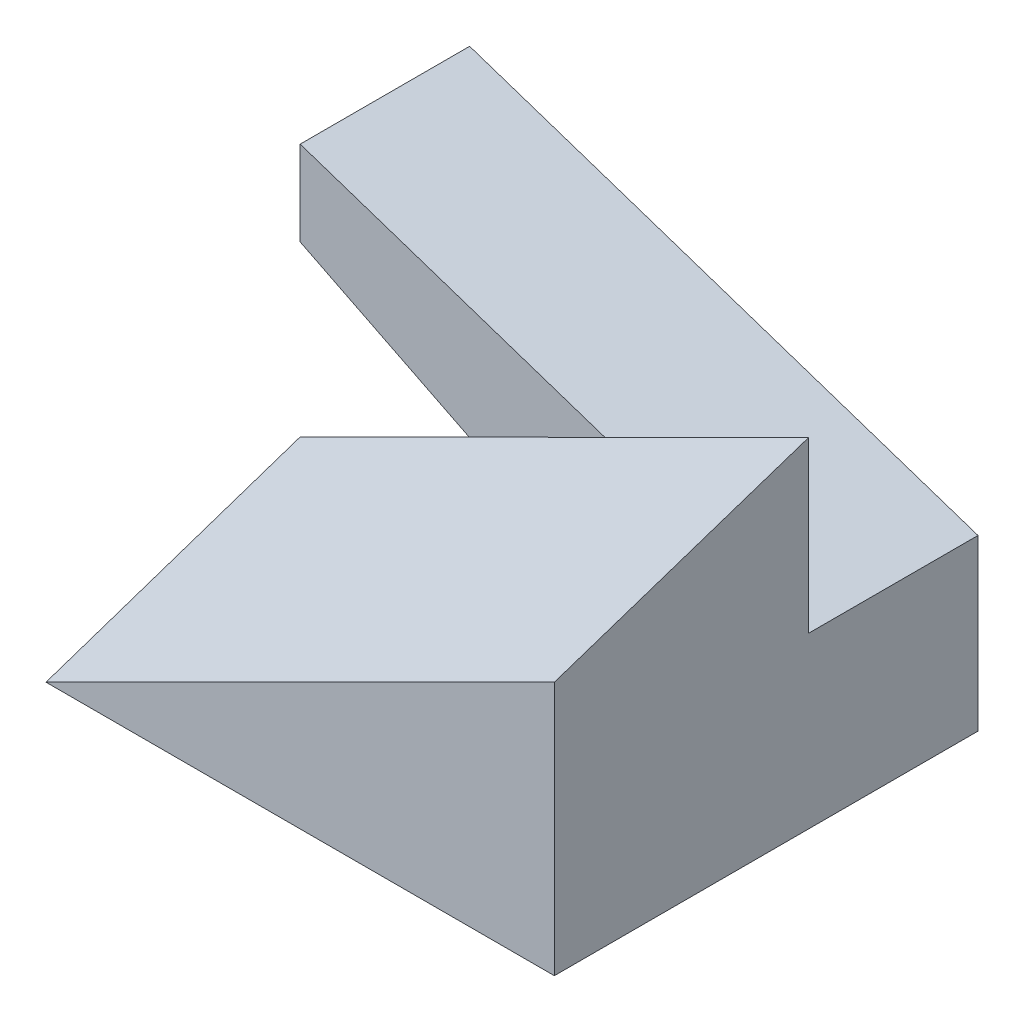
ISO-10303-21;
HEADER;
FILE_DESCRIPTION(('STEP AP214'),'2;1');
FILE_NAME('part.step','',(''),(''),'','','');
FILE_SCHEMA(('AUTOMOTIVE_DESIGN { 1 0 10303 214 1 1 1 1 }'));
ENDSEC;
DATA;
#1=APPLICATION_CONTEXT('core data for automotive mechanical design processes');
#2=APPLICATION_PROTOCOL_DEFINITION('international standard','automotive_design',2000,#1);
#3=PRODUCT_CONTEXT('',#1,'mechanical');
#4=PRODUCT('Part','Part','',(#3));
#5=PRODUCT_RELATED_PRODUCT_CATEGORY('part','',(#4));
#6=PRODUCT_DEFINITION_FORMATION('','',#4);
#7=PRODUCT_DEFINITION_CONTEXT('part definition',#1,'design');
#8=PRODUCT_DEFINITION('design','',#6,#7);
#9=PRODUCT_DEFINITION_SHAPE('','',#8);
#10=(LENGTH_UNIT() NAMED_UNIT(*) SI_UNIT(.MILLI.,.METRE.));
#11=(NAMED_UNIT(*) PLANE_ANGLE_UNIT() SI_UNIT($,.RADIAN.));
#12=(NAMED_UNIT(*) SI_UNIT($,.STERADIAN.) SOLID_ANGLE_UNIT());
#13=UNCERTAINTY_MEASURE_WITH_UNIT(LENGTH_MEASURE(1.E-05),#10,'distance_accuracy_value','');
#14=(GEOMETRIC_REPRESENTATION_CONTEXT(3) GLOBAL_UNCERTAINTY_ASSIGNED_CONTEXT((#13)) GLOBAL_UNIT_ASSIGNED_CONTEXT((#10,
#11,#12)) REPRESENTATION_CONTEXT('',''));
#15=CARTESIAN_POINT('',(0.,0.,0.));
#16=DIRECTION('',(0.,0.,1.));
#17=DIRECTION('',(1.,0.,0.));
#18=AXIS2_PLACEMENT_3D('',#15,#16,#17);
#19=CARTESIAN_POINT('',(0.,0.,10.));
#20=DIRECTION('',(1.,0.,0.));
#21=DIRECTION('',(0.,1.,0.));
#22=AXIS2_PLACEMENT_3D('',#19,#20,#21);
#23=PLANE('',#22);
#24=DIRECTION('',(0.,1.,0.));
#25=VECTOR('',#24,1.);
#26=CARTESIAN_POINT('',(0.,0.,10.));
#27=LINE('',#26,#25);
#28=CARTESIAN_POINT('',(0.,10.,10.));
#29=VERTEX_POINT('',#28);
#30=CARTESIAN_POINT('',(-9.62082689756443E-05,20.,10.0001439548259));
#31=VERTEX_POINT('',#30);
#32=EDGE_CURVE('E188',#29,#31,#27,.T.);
#33=ORIENTED_EDGE('',*,*,#32,.T.);
#34=CARTESIAN_POINT('',(8.03122140087824E-05,14.9998391758466,24.9999461922235));
#35=CARTESIAN_POINT('',(6.35012130422337E-05,15.2082061743106,24.3749574513333));
#36=CARTESIAN_POINT('',(4.86212731302606E-05,15.416569304491,23.7499674207438));
#37=CARTESIAN_POINT('',(2.23689033569722E-05,15.8332885411089,22.4999850095946));
#38=CARTESIAN_POINT('',(1.09964735376733E-05,16.0416446475464,21.8749926290348));
#39=CARTESIAN_POINT('',(-8.59548782981062E-06,16.458350546783,20.6250057555317));
#40=CARTESIAN_POINT('',(-1.6815019343616E-05,16.666700339582,20.0000112625884));
#41=CARTESIAN_POINT('',(-3.04486313341584E-05,17.0833943073055,18.7500203970858));
#42=CARTESIAN_POINT('',(-3.58627117833175E-05,17.2917384822299,18.1250240245265));
#43=CARTESIAN_POINT('',(-4.41882518469558E-05,17.7084218206219,16.8750296026702));
#44=CARTESIAN_POINT('',(-4.70997114392251E-05,17.9167609840895,16.2500315533733));
#45=CARTESIAN_POINT('',(-5.06462935525459E-05,18.3334347527002,15.0000339296414));
#46=CARTESIAN_POINT('',(-5.12814160550357E-05,18.5417693578433,14.3750343552064));
#47=CARTESIAN_POINT('',(-5.04103735177367E-05,18.9584342802512,13.1250337716458));
#48=CARTESIAN_POINT('',(-4.89042084612787E-05,19.1667645975159,12.5000327625202));
#49=CARTESIAN_POINT('',(-4.37098700090829E-05,19.5834208626023,11.2500292823616));
#50=CARTESIAN_POINT('',(-4.00216965961392E-05,19.791746810424,10.6250268113287));
#51=CARTESIAN_POINT('',(-3.52221586328211E-05,20.0000705319099,10.0000235982293));
#52=B_SPLINE_CURVE_WITH_KNOTS('',3,(#34,#35,#36,#37,#38,#39,#40,#41,#42,#43,#44,#45,#46,#47,#48,
#49,#50,#51),.UNSPECIFIED.,.F.,.F.,(4,2,2,2,2,2,2,2,4),(0.,1.97642343464449,3.95284689296459,
5.92927037283589,7.90569387213563,9.88211738897551,11.8585409219316,13.8349644702735,
15.8113880342004),.UNSPECIFIED.);
#53=CARTESIAN_POINT('',(0.,14.9998905412113,25.));
#54=VERTEX_POINT('',#53);
#55=EDGE_CURVE('E192',#31,#54,#52,.F.);
#56=ORIENTED_EDGE('',*,*,#55,.T.);
#57=DIRECTION('',(0.,1.,0.));
#58=VECTOR('',#57,1.);
#59=CARTESIAN_POINT('',(0.,0.,25.));
#60=LINE('',#59,#58);
#61=CARTESIAN_POINT('',(0.,0.,25.));
#62=VERTEX_POINT('',#61);
#63=EDGE_CURVE('E127',#62,#54,#60,.T.);
#64=ORIENTED_EDGE('',*,*,#63,.F.);
#65=DIRECTION('',(0.,0.,-1.));
#66=VECTOR('',#65,1.);
#67=CARTESIAN_POINT('',(0.,0.,25.));
#68=LINE('',#67,#66);
#69=CARTESIAN_POINT('',(0.,0.,10.));
#70=VERTEX_POINT('',#69);
#71=EDGE_CURVE('E204',#62,#70,#68,.T.);
#72=ORIENTED_EDGE('',*,*,#71,.T.);
#73=DIRECTION('',(0.,0.,-1.));
#74=VECTOR('',#73,1.);
#75=CARTESIAN_POINT('',(0.,0.,10.));
#76=LINE('',#75,#74);
#77=CARTESIAN_POINT('',(0.,0.,0.));
#78=VERTEX_POINT('',#77);
#79=EDGE_CURVE('E46',#70,#78,#76,.T.);
#80=ORIENTED_EDGE('',*,*,#79,.T.);
#81=DIRECTION('',(0.,-1.,0.));
#82=VECTOR('',#81,1.);
#83=CARTESIAN_POINT('',(0.,0.,0.));
#84=LINE('',#83,#82);
#85=CARTESIAN_POINT('',(0.,10.,0.));
#86=VERTEX_POINT('',#85);
#87=EDGE_CURVE('E98',#86,#78,#84,.T.);
#88=ORIENTED_EDGE('',*,*,#87,.F.);
#89=DIRECTION('',(0.,0.,-1.));
#90=VECTOR('',#89,1.);
#91=CARTESIAN_POINT('',(0.,10.,10.));
#92=LINE('',#91,#90);
#93=EDGE_CURVE('E83',#29,#86,#92,.T.);
#94=ORIENTED_EDGE('',*,*,#93,.F.);
#95=EDGE_LOOP('',(#33,#56,#64,#72,#80,#88,#94));
#96=FACE_BOUND('',#95,.T.);
#97=ADVANCED_FACE('F35',(#96),#23,.T.);
#98=CARTESIAN_POINT('',(-30.,0.,10.));
#99=DIRECTION('',(1.,0.,0.));
#100=DIRECTION('',(0.,0.,-1.));
#101=AXIS2_PLACEMENT_3D('',#98,#99,#100);
#102=PLANE('',#101);
#103=CARTESIAN_POINT('',(-29.9999195215301,5.03709544995943,9.99994608131372));
#104=CARTESIAN_POINT('',(-29.9999364501063,4.82724365590827,10.6249574271417));
#105=CARTESIAN_POINT('',(-29.9999514282421,4.6173879575063,11.249967462098));
#106=CARTESIAN_POINT('',(-29.999977842452,4.19766946777028,12.4999851588911));
#107=CARTESIAN_POINT('',(-29.999989278526,3.98780667643615,13.124992820728));
#108=CARTESIAN_POINT('',(-30.0000089674312,3.56807471936659,14.3750060116822));
#109=CARTESIAN_POINT('',(-30.0000172202623,3.35820555363109,15.0000115407996));
#110=CARTESIAN_POINT('',(-30.0000308923769,2.93846154801389,16.2500207006205));
#111=CARTESIAN_POINT('',(-30.0000363116605,2.72858670813213,16.8750243313241));
#112=CARTESIAN_POINT('',(-30.0000446201981,2.30883196200928,18.1250298976819));
#113=CARTESIAN_POINT('',(-30.0000475094523,2.09895205576814,18.7500318333362));
#114=CARTESIAN_POINT('',(-30.0000509831,1.67918762782197,20.0000341604611));
#115=CARTESIAN_POINT('',(-30.0000515674936,1.46930310611689,20.6250345519319));
#116=CARTESIAN_POINT('',(-30.0000505637158,1.04952971215167,21.8750338793591));
#117=CARTESIAN_POINT('',(-30.0000489755444,0.839640839891496,22.5000328153156));
#118=CARTESIAN_POINT('',(-30.000043580842,0.419858653135191,23.7500292009665));
#119=CARTESIAN_POINT('',(-30.000039774311,0.209965338639028,24.3750266506609));
#120=CARTESIAN_POINT('',(-30.0000348357029,6.97580373458341E-05,25.0000233393107));
#121=B_SPLINE_CURVE_WITH_KNOTS('',3,(#103,#104,#105,#106,#107,#108,#109,#110,#111,#112,#113,
#114,#115,#116,#117,#118,#119,#120),.UNSPECIFIED.,.F.,.F.,(4,2,2,2,2,2,2,2,4),(0.,
1.97790106511213,3.95580215410806,5.93370326484462,7.91160439518943,9.8895055432549,
11.867406707629,13.8453078876055,15.8232090834202),.UNSPECIFIED.);
#122=CARTESIAN_POINT('',(-30.0000088208538,6.45606431844688E-05,25.0000059098175));
#123=VERTEX_POINT('',#122);
#124=CARTESIAN_POINT('',(-30.,5.03714690622466,10.));
#125=VERTEX_POINT('',#124);
#126=EDGE_CURVE('E167',#123,#125,#121,.F.);
#127=ORIENTED_EDGE('',*,*,#126,.T.);
#128=DIRECTION('',(0.,-1.,0.));
#129=VECTOR('',#128,1.);
#130=CARTESIAN_POINT('',(-30.,0.,10.));
#131=LINE('',#130,#129);
#132=CARTESIAN_POINT('',(-30.,0.,10.));
#133=VERTEX_POINT('',#132);
#134=EDGE_CURVE('E196',#125,#133,#131,.T.);
#135=ORIENTED_EDGE('',*,*,#134,.T.);
#136=DIRECTION('',(0.,0.,-1.));
#137=VECTOR('',#136,1.);
#138=CARTESIAN_POINT('',(-30.,0.,25.));
#139=LINE('',#138,#137);
#140=EDGE_CURVE('E232',#123,#133,#139,.T.);
#141=ORIENTED_EDGE('',*,*,#140,.F.);
#142=EDGE_LOOP('',(#127,#135,#141));
#143=FACE_BOUND('',#142,.T.);
#144=ADVANCED_FACE('F173',(#143),#102,.F.);
#145=DIRECTION('',(0.,1.,0.));
#146=VECTOR('',#145,1.);
#147=CARTESIAN_POINT('',(-30.,5.03725660719902,10.));
#148=LINE('',#147,#146);
#149=CARTESIAN_POINT('',(-30.,15.,10.));
#150=VERTEX_POINT('',#149);
#151=CARTESIAN_POINT('',(-30.,20.,10.));
#152=VERTEX_POINT('',#151);
#153=EDGE_CURVE('E81',#150,#152,#148,.T.);
#154=ORIENTED_EDGE('',*,*,#153,.T.);
#155=DIRECTION('',(0.,0.,-1.));
#156=VECTOR('',#155,1.);
#157=CARTESIAN_POINT('',(-30.,20.,10.));
#158=LINE('',#157,#156);
#159=CARTESIAN_POINT('',(-30.,20.,0.));
#160=VERTEX_POINT('',#159);
#161=EDGE_CURVE('E73',#152,#160,#158,.T.);
#162=ORIENTED_EDGE('',*,*,#161,.T.);
#163=DIRECTION('',(0.,-1.,0.));
#164=VECTOR('',#163,1.);
#165=CARTESIAN_POINT('',(-30.,0.,0.));
#166=LINE('',#165,#164);
#167=CARTESIAN_POINT('',(-30.,15.,0.));
#168=VERTEX_POINT('',#167);
#169=EDGE_CURVE('E77',#160,#168,#166,.T.);
#170=ORIENTED_EDGE('',*,*,#169,.T.);
#171=DIRECTION('',(0.,0.,-1.));
#172=VECTOR('',#171,1.);
#173=CARTESIAN_POINT('',(-30.,15.,10.));
#174=LINE('',#173,#172);
#175=EDGE_CURVE('E84',#150,#168,#174,.T.);
#176=ORIENTED_EDGE('',*,*,#175,.F.);
#177=EDGE_LOOP('',(#154,#162,#170,#176));
#178=FACE_BOUND('',#177,.T.);
#179=ADVANCED_FACE('F75',(#178),#102,.F.);
#180=CARTESIAN_POINT('',(0.,0.,10.));
#181=DIRECTION('',(0.,0.,1.));
#182=DIRECTION('',(1.,0.,0.));
#183=AXIS2_PLACEMENT_3D('',#180,#181,#182);
#184=PLANE('',#183);
#185=CARTESIAN_POINT('',(-20.024832816438,10.0124029399315,9.99998681339724));
#186=CARTESIAN_POINT('',(-20.4404617047106,9.80509901274454,9.99998530076057));
#187=CARTESIAN_POINT('',(-20.8560907076221,9.59779531539958,9.99998386500472));
#188=CARTESIAN_POINT('',(-21.6873488731626,9.18318824054216,9.99998110050104));
#189=CARTESIAN_POINT('',(-22.1029780357917,8.97588486302971,9.99997977175323));
#190=CARTESIAN_POINT('',(-22.9342364509758,8.56127828810137,9.99997717451203));
#191=CARTESIAN_POINT('',(-23.3498657035308,8.35397509068548,9.99997590601865));
#192=CARTESIAN_POINT('',(-24.1811241772328,7.93936863297667,9.99997334799365));
#193=CARTESIAN_POINT('',(-24.5967533983798,7.73206537268375,9.99997205846203));
#194=CARTESIAN_POINT('',(-25.4280116457252,7.3174584617359,9.99996934879199));
#195=CARTESIAN_POINT('',(-25.8436406719235,7.11015481108097,9.99996792865358));
#196=CARTESIAN_POINT('',(-26.6748983149174,6.69554668996611,9.99996481408907));
#197=CARTESIAN_POINT('',(-27.090526931713,6.4882422195062,9.99996311966298));
#198=CARTESIAN_POINT('',(-27.921783493132,6.07363193259575,9.99995928047399));
#199=CARTESIAN_POINT('',(-28.3374114377553,5.86632611614523,9.9999571357111));
#200=CARTESIAN_POINT('',(-29.1686663191425,5.45171246501861,9.99995217093704));
#201=CARTESIAN_POINT('',(-29.5842932559063,5.24440463034252,9.99994935092588));
#202=CARTESIAN_POINT('',(-29.9999195215301,5.0370954501202,9.99994608083486));
#203=B_SPLINE_CURVE_WITH_KNOTS('',3,(#185,#186,#187,#188,#189,#190,#191,#192,#193,#194,#195,
#196,#197,#198,#199,#200,#201,#202),.UNSPECIFIED.,.F.,.F.,(4,2,2,2,2,2,2,2,4),(0.,
1.39337741440172,2.78675482932492,4.18013224451403,5.57350965957747,6.96688707397658,
8.36026448701699,9.75364189784338,11.1470193054391),.UNSPECIFIED.);
#204=CARTESIAN_POINT('',(-20.0248426476446,10.0124226513033,9.99999340669862));
#205=VERTEX_POINT('',#204);
#206=EDGE_CURVE('E200',#125,#205,#203,.F.);
#207=ORIENTED_EDGE('',*,*,#206,.T.);
#208=DIRECTION('',(-0.894427190999916,0.447213595499958,0.));
#209=VECTOR('',#208,1.);
#210=CARTESIAN_POINT('',(0.,0.,10.));
#211=LINE('',#210,#209);
#212=EDGE_CURVE('E93',#70,#205,#211,.T.);
#213=ORIENTED_EDGE('',*,*,#212,.F.);
#214=DIRECTION('',(1.,0.,0.));
#215=VECTOR('',#214,1.);
#216=CARTESIAN_POINT('',(0.,0.,10.));
#217=LINE('',#216,#215);
#218=EDGE_CURVE('E198',#133,#70,#217,.T.);
#219=ORIENTED_EDGE('',*,*,#218,.F.);
#220=ORIENTED_EDGE('',*,*,#134,.F.);
#221=EDGE_LOOP('',(#207,#213,#219,#220));
#222=FACE_BOUND('',#221,.T.);
#223=ADVANCED_FACE('F130',(#222),#184,.F.);
#224=CARTESIAN_POINT('',(0.,0.,25.));
#225=DIRECTION('',(0.,0.,1.));
#226=DIRECTION('',(1.,0.,0.));
#227=AXIS2_PLACEMENT_3D('',#224,#225,#226);
#228=PLANE('',#227);
#229=ORIENTED_EDGE('',*,*,#63,.T.);
#230=CARTESIAN_POINT('',(-30.0000348357029,6.97580373392273E-05,25.0000233393107));
#231=CARTESIAN_POINT('',(-28.7500483500979,0.625096806751688,25.000032390055));
#232=CARTESIAN_POINT('',(-27.5000560097484,1.25011214641075,25.0000375222373));
#233=CARTESIAN_POINT('',(-25.0000625549565,2.50012525572308,25.0000419081133));
#234=CARTESIAN_POINT('',(-23.7500614405142,3.12512302537647,25.000041161807));
#235=CARTESIAN_POINT('',(-21.2500533608829,4.37510684880745,25.0000357493416));
#236=CARTESIAN_POINT('',(-20.0000463956939,5.0000929025851,25.0000310831825));
#237=CARTESIAN_POINT('',(-17.5000302215098,6.25006051665659,25.0000202474753));
#238=CARTESIAN_POINT('',(-16.2500210125146,6.87504207695044,25.0000140779273));
#239=CARTESIAN_POINT('',(-13.7500033032552,8.12500661613528,25.0000022135007));
#240=CARTESIAN_POINT('',(-12.4999948029909,8.74998959502628,24.999996518622));
#241=CARTESIAN_POINT('',(-9.99997988636433,9.999959724923,24.9999865248092));
#242=CARTESIAN_POINT('',(-8.7499734700021,10.6249468759287,24.9999822258751));
#243=CARTESIAN_POINT('',(-6.24996194685122,11.8749237985084,24.9999745049067));
#244=CARTESIAN_POINT('',(-4.99995684006257,12.4999135700824,24.9999710828724));
#245=CARTESIAN_POINT('',(-2.49994260993918,13.7498850701496,24.9999615477884));
#246=CARTESIAN_POINT('',(-1.24993348660444,14.3748667986428,24.9999554347387));
#247=CARTESIAN_POINT('',(8.03122140060719E-05,14.9998391758466,24.9999461922235));
#248=B_SPLINE_CURVE_WITH_KNOTS('',3,(#230,#231,#232,#233,#234,#235,#236,#237,#238,#239,#240,
#241,#242,#243,#244,#245,#246,#247),.UNSPECIFIED.,.F.,.F.,(4,2,2,2,2,2,2,2,4),(0.,
4.19262748538467,8.38525494110817,12.5778823779259,16.770509807101,20.9631372377183,
25.1557646739422,29.348392111962,33.5410195369574),.UNSPECIFIED.);
#249=EDGE_CURVE('E226',#54,#123,#248,.F.);
#250=ORIENTED_EDGE('',*,*,#249,.T.);
#251=DIRECTION('',(1.,0.,0.));
#252=VECTOR('',#251,1.);
#253=CARTESIAN_POINT('',(0.,0.,25.));
#254=LINE('',#253,#252);
#255=EDGE_CURVE('E229',#123,#62,#254,.T.);
#256=ORIENTED_EDGE('',*,*,#255,.T.);
#257=EDGE_LOOP('',(#229,#250,#256));
#258=FACE_BOUND('',#257,.T.);
#259=ADVANCED_FACE('F140',(#258),#228,.T.);
#260=CARTESIAN_POINT('',(-3.52221586323467E-05,20.0000705319099,10.0000235982293));
#261=CARTESIAN_POINT('',(-0.500788223389328,19.7503290391633,10.0000271150311));
#262=CARTESIAN_POINT('',(-1.00154035798455,19.500585808735,10.0000300505982));
#263=CARTESIAN_POINT('',(-2.00304301268113,19.0010961148756,10.0000348400498));
#264=CARTESIAN_POINT('',(-2.5037935327825,18.7513496514446,10.0000366939343));
#265=CARTESIAN_POINT('',(-3.50529307907928,18.2518537330373,10.0000394008076));
#266=CARTESIAN_POINT('',(-4.00604210527468,18.002104278061,10.0000402537964));
#267=CARTESIAN_POINT('',(-5.00753883426901,17.5026027180166,10.0000410731195));
#268=CARTESIAN_POINT('',(-5.50828653706794,17.2528506129485,10.0000410394537));
#269=CARTESIAN_POINT('',(-6.50978081432943,16.7533441433284,10.0000402161553));
#270=CARTESIAN_POINT('',(-7.010527388792,16.5035897787763,10.0000394265225));
#271=CARTESIAN_POINT('',(-8.01201962347123,16.0040792189051,10.0000372347279));
#272=CARTESIAN_POINT('',(-8.51276528368788,15.7543230235859,10.0000358325659));
#273=CARTESIAN_POINT('',(-9.51425591325013,15.2548092494907,10.0000325653715));
#274=CARTESIAN_POINT('',(-10.0150008825957,15.0050516707147,10.0000307003389));
#275=CARTESIAN_POINT('',(-11.0164903503089,14.5055355700353,10.0000266547268));
#276=CARTESIAN_POINT('',(-11.5172348486765,14.255777048132,10.0000244741473));
#277=CARTESIAN_POINT('',(-12.0179792216212,14.00601827477,10.0000222094559));
#278=B_SPLINE_CURVE_WITH_KNOTS('',3,(#260,#261,#262,#263,#264,#265,#266,#267,#268,#269,#270,
#271,#272,#273,#274,#275,#276,#277),.UNSPECIFIED.,.F.,.F.,(4,2,2,2,2,2,2,2,4),(0.,
1.67872553833464,3.35745107111006,5.03617659883749,6.71490212213611,8.39362764169788,
10.0723531582557,11.7510786725539,13.429804185321),.UNSPECIFIED.);
#279=CARTESIAN_POINT('',(-12.0179626634709,14.0059850760112,10.000011104728));
#280=VERTEX_POINT('',#279);
#281=EDGE_CURVE('E11',#31,#280,#278,.T.);
#282=ORIENTED_EDGE('',*,*,#281,.F.);
#283=ORIENTED_EDGE('',*,*,#32,.F.);
#284=DIRECTION('',(0.948683298050514,-0.316227766016838,0.));
#285=VECTOR('',#284,1.);
#286=CARTESIAN_POINT('',(3.,9.,10.));
#287=LINE('',#286,#285);
#288=EDGE_CURVE('E54',#280,#29,#287,.T.);
#289=ORIENTED_EDGE('',*,*,#288,.F.);
#290=EDGE_LOOP('',(#282,#283,#289));
#291=FACE_BOUND('',#290,.T.);
#292=ADVANCED_FACE('F142',(#291),#184,.F.);
#293=CARTESIAN_POINT('',(0.,0.,10.));
#294=DIRECTION('',(-0.447213595499958,-0.894427190999916,0.));
#295=DIRECTION('',(0.894427190999916,-0.447213595499958,0.));
#296=AXIS2_PLACEMENT_3D('',#293,#294,#295);
#297=PLANE('',#296);
#298=DIRECTION('',(-0.894427190999916,0.447213595499958,0.));
#299=VECTOR('',#298,1.);
#300=CARTESIAN_POINT('',(0.,0.,0.));
#301=LINE('',#300,#299);
#302=EDGE_CURVE('E92',#78,#168,#301,.T.);
#303=ORIENTED_EDGE('',*,*,#302,.F.);
#304=ORIENTED_EDGE('',*,*,#79,.F.);
#305=ORIENTED_EDGE('',*,*,#212,.T.);
#306=DIRECTION('',(-0.894427190999916,0.447213595499958,0.));
#307=VECTOR('',#306,1.);
#308=CARTESIAN_POINT('',(0.,0.,10.));
#309=LINE('',#308,#307);
#310=EDGE_CURVE('E197',#205,#150,#309,.T.);
#311=ORIENTED_EDGE('',*,*,#310,.T.);
#312=ORIENTED_EDGE('',*,*,#175,.T.);
#313=EDGE_LOOP('',(#303,#304,#305,#311,#312));
#314=FACE_BOUND('',#313,.T.);
#315=ADVANCED_FACE('F37',(#314),#297,.T.);
#316=CARTESIAN_POINT('',(3.,9.,10.));
#317=DIRECTION('',(0.316227766016838,0.948683298050514,0.));
#318=DIRECTION('',(-0.948683298050514,0.316227766016838,0.));
#319=AXIS2_PLACEMENT_3D('',#316,#317,#318);
#320=PLANE('',#319);
#321=DIRECTION('',(0.948683298050514,-0.316227766016838,0.));
#322=VECTOR('',#321,1.);
#323=CARTESIAN_POINT('',(3.,9.,0.));
#324=LINE('',#323,#322);
#325=EDGE_CURVE('E90',#160,#86,#324,.T.);
#326=ORIENTED_EDGE('',*,*,#325,.F.);
#327=ORIENTED_EDGE('',*,*,#161,.F.);
#328=EDGE_CURVE('E107',#152,#280,#287,.T.);
#329=ORIENTED_EDGE('',*,*,#328,.T.);
#330=ORIENTED_EDGE('',*,*,#288,.T.);
#331=ORIENTED_EDGE('',*,*,#93,.T.);
#332=EDGE_LOOP('',(#326,#327,#329,#330,#331));
#333=FACE_BOUND('',#332,.T.);
#334=ADVANCED_FACE('F95',(#333),#320,.T.);
#335=CARTESIAN_POINT('',(0.,0.,0.));
#336=DIRECTION('',(0.,0.,1.));
#337=DIRECTION('',(1.,0.,0.));
#338=AXIS2_PLACEMENT_3D('',#335,#336,#337);
#339=PLANE('',#338);
#340=ORIENTED_EDGE('',*,*,#302,.T.);
#341=ORIENTED_EDGE('',*,*,#169,.F.);
#342=ORIENTED_EDGE('',*,*,#325,.T.);
#343=ORIENTED_EDGE('',*,*,#87,.T.);
#344=EDGE_LOOP('',(#340,#341,#342,#343));
#345=FACE_BOUND('',#344,.T.);
#346=ADVANCED_FACE('F88',(#345),#339,.F.);
#347=CARTESIAN_POINT('',(0.,0.,25.));
#348=DIRECTION('',(0.,1.,0.));
#349=DIRECTION('',(0.,0.,1.));
#350=AXIS2_PLACEMENT_3D('',#347,#348,#349);
#351=PLANE('',#350);
#352=ORIENTED_EDGE('',*,*,#218,.T.);
#353=ORIENTED_EDGE('',*,*,#71,.F.);
#354=ORIENTED_EDGE('',*,*,#255,.F.);
#355=ORIENTED_EDGE('',*,*,#140,.T.);
#356=EDGE_LOOP('',(#352,#353,#354,#355));
#357=FACE_BOUND('',#356,.T.);
#358=ADVANCED_FACE('F145',(#357),#351,.F.);
#359=CARTESIAN_POINT('',(-30.,5.03725660719902,10.));
#360=DIRECTION('',(0.,0.,1.));
#361=DIRECTION('',(1.,0.,0.));
#362=AXIS2_PLACEMENT_3D('',#359,#360,#361);
#363=PLANE('',#362);
#364=CARTESIAN_POINT('',(-12.0179792216212,14.00601827477,10.0000222094559));
#365=CARTESIAN_POINT('',(-12.3515980684064,13.8396175298019,10.0000206991421));
#366=CARTESIAN_POINT('',(-12.685216859495,13.6732166731674,10.0000191514765));
#367=CARTESIAN_POINT('',(-13.3524543839218,13.3404148442543,10.0000160174536));
#368=CARTESIAN_POINT('',(-13.6860731172601,13.1740138719757,10.0000144310963));
#369=CARTESIAN_POINT('',(-14.3533105799359,12.8412119194099,10.000011255702));
#370=CARTESIAN_POINT('',(-14.6869293092733,12.6748109391227,10.000009666665));
#371=CARTESIAN_POINT('',(-15.3541668098477,12.3420090624545,10.0000065166638));
#372=CARTESIAN_POINT('',(-15.6877855810846,12.1756081660736,10.0000049556996));
#373=CARTESIAN_POINT('',(-16.35502320409,11.8428065345785,10.0000018877268));
#374=CARTESIAN_POINT('',(-16.6886420558584,11.6764057994644,10.0000003807182));
#375=CARTESIAN_POINT('',(-17.3558798692458,11.3436045492141,9.99999744029996));
#376=CARTESIAN_POINT('',(-17.6894988308647,11.1772040340779,9.9999960068903));
#377=CARTESIAN_POINT('',(-18.3567368839829,10.8444032638952,9.99999322709012));
#378=CARTESIAN_POINT('',(-18.6903559754822,10.6780030088486,9.99999188069959));
#379=CARTESIAN_POINT('',(-19.3575942934727,10.3452027690753,9.99998927836087));
#380=CARTESIAN_POINT('',(-19.6912135199641,10.1788027843486,9.99998802241268));
#381=CARTESIAN_POINT('',(-20.024832816438,10.0124029399315,9.99998681339724));
#382=B_SPLINE_CURVE_WITH_KNOTS('',3,(#364,#365,#366,#367,#368,#369,#370,#371,#372,#373,#374,
#375,#376,#377,#378,#379,#380,#381),.UNSPECIFIED.,.F.,.F.,(4,2,2,2,2,2,2,2,4),(0.,
1.1184438679372,2.23688773568753,3.3553316034207,4.4737754712855,5.59221933940603,
6.71066320787768,7.82910707676299,8.9475509460874),.UNSPECIFIED.);
#383=EDGE_CURVE('E317',#205,#280,#382,.F.);
#384=ORIENTED_EDGE('',*,*,#383,.T.);
#385=ORIENTED_EDGE('',*,*,#328,.F.);
#386=ORIENTED_EDGE('',*,*,#153,.F.);
#387=ORIENTED_EDGE('',*,*,#310,.F.);
#388=EDGE_LOOP('',(#384,#385,#386,#387));
#389=FACE_BOUND('',#388,.T.);
#390=ADVANCED_FACE('F278',(#389),#363,.T.);
#391=CARTESIAN_POINT('',(-30.2973000504137,-0.205373993689942,25.1691465108743));
#392=CARTESIAN_POINT('',(-30.7105339107085,0.616921615836509,22.1056095767058));
#393=CARTESIAN_POINT('',(-31.1238367977349,1.43935545048636,19.0421188892384));
#394=CARTESIAN_POINT('',(-31.5372172073362,2.26194452307375,15.9786801405382));
#395=CARTESIAN_POINT('',(-31.9506679127865,3.0846743621754,12.9152884888255));
#396=CARTESIAN_POINT('',(-32.3641785738126,3.90752426152979,9.85193700629824));
#397=CARTESIAN_POINT('',(-23.7682883699179,3.06076910492065,25.1651363406304));
#398=CARTESIAN_POINT('',(-24.1809365220219,3.8818918414901,22.101206992234));
#399=CARTESIAN_POINT('',(-24.5936534348822,4.70315227057052,19.0373237123398));
#400=CARTESIAN_POINT('',(-25.0064375873595,5.52454734610078,15.9734854818112));
#401=CARTESIAN_POINT('',(-25.4192831060702,6.34606530670705,12.909688365584));
#402=CARTESIAN_POINT('',(-25.8321876717595,7.16770150811243,9.84593080979818));
#403=CARTESIAN_POINT('',(-17.239151712739,6.32666193936533,25.1610424381981));
#404=CARTESIAN_POINT('',(-17.6512215137955,7.14662653556032,22.0967256047308));
#405=CARTESIAN_POINT('',(-18.0633412058925,7.96669103790861,19.0324421973869));
#406=CARTESIAN_POINT('',(-18.475512841685,8.78685955682453,15.9681935914089));
#407=CARTESIAN_POINT('',(-18.8877120941395,9.60708337774341,12.9039634881107));
#408=CARTESIAN_POINT('',(-19.2999558962558,10.4273964087746,9.83976323230556));
#409=CARTESIAN_POINT('',(-10.7099113963586,9.59234719762092,25.1568790859166));
#410=CARTESIAN_POINT('',(-11.1214419937392,10.4112320455388,22.0922009954317));
#411=CARTESIAN_POINT('',(-11.5330170910111,11.2302060039046,19.0275527190946));
#412=CARTESIAN_POINT('',(-11.9446198336999,12.0492353218544,15.9629229647025));
#413=CARTESIAN_POINT('',(-12.3562746069982,12.8683688304161,12.8983280699073));
#414=CARTESIAN_POINT('',(-12.7679792806409,13.6876022637618,9.83376660746876));
#415=CARTESIAN_POINT('',(-4.18092783780031,12.8585466100419,25.1528877568782));
#416=CARTESIAN_POINT('',(-4.5917977392837,13.6761084231058,22.0877670117157));
#417=CARTESIAN_POINT('',(-5.00272644784903,14.4937879965787,19.022685666268));
#418=CARTESIAN_POINT('',(-5.4137162357407,15.3115898806001,15.9576452428989));
#419=CARTESIAN_POINT('',(-5.82477312622788,16.1295261366875,12.8926497770935));
#420=CARTESIAN_POINT('',(-6.23589866485273,16.9475998597686,9.82770030433772));
#421=CARTESIAN_POINT('',(2.34829393687388,16.1242689978205,25.1487368272151));
#422=CARTESIAN_POINT('',(1.93803083493483,16.9406157027689,22.0832095369872));
#423=CARTESIAN_POINT('',(1.52770805129307,17.7570819195428,19.0177222324547));
#424=CARTESIAN_POINT('',(1.11731541622017,18.5736880128899,15.9522817271574));
#425=CARTESIAN_POINT('',(0.706845519328001,19.3904488220151,12.8868929859257));
#426=CARTESIAN_POINT('',(0.296306681227305,20.2073476850045,9.82155043409601));
#427=B_SPLINE_SURFACE_WITH_KNOTS('',5,5,((#391,#392,#393,#394,#395,#396),(#397,#398,#399,#400,
#401,#402),(#403,#404,#405,#406,#407,#408),(#409,#410,#411,#412,#413,#414),(#415,#416,#417,#418,
#419,#420),(#421,#422,#423,#424,#425,#426)),.UNSPECIFIED.,.F.,.F.,.F.,(6,6),(6,6),
(-18.255136690529,18.2468106711913),(-7.99455860117133,7.99933158602883),.UNSPECIFIED.);
#428=ORIENTED_EDGE('',*,*,#126,.F.);
#429=ORIENTED_EDGE('',*,*,#249,.F.);
#430=ORIENTED_EDGE('',*,*,#55,.F.);
#431=ORIENTED_EDGE('',*,*,#281,.T.);
#432=ORIENTED_EDGE('',*,*,#383,.F.);
#433=ORIENTED_EDGE('',*,*,#206,.F.);
#434=EDGE_LOOP('',(#428,#429,#430,#431,#432,#433));
#435=FACE_BOUND('',#434,.T.);
#436=ADVANCED_FACE('F261',(#435),#427,.T.);
#437=CLOSED_SHELL('',(#97,#144,#179,#223,#259,#292,#315,#334,#346,#358,#390,#436));
#438=MANIFOLD_SOLID_BREP('B2',#437);
#439=ADVANCED_BREP_SHAPE_REPRESENTATION('',(#18,#438),#14);
#440=SHAPE_DEFINITION_REPRESENTATION(#9,#439);
ENDSEC;
END-ISO-10303-21;
